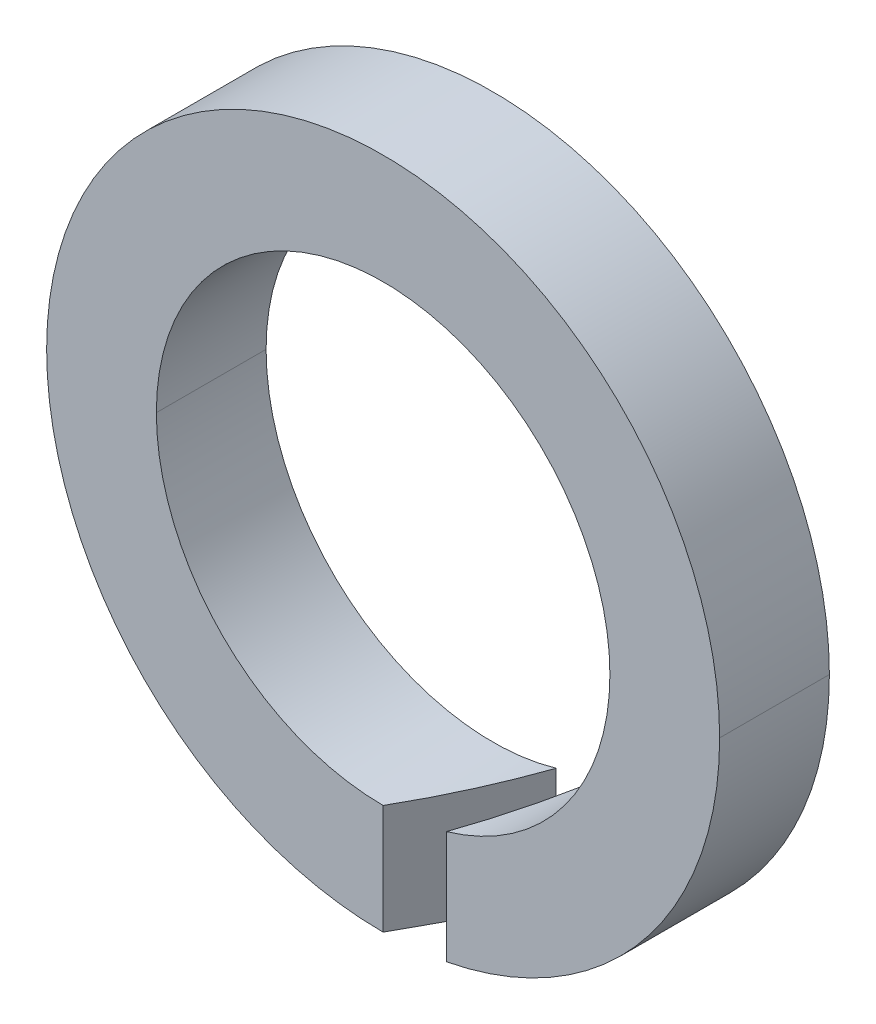
ISO-10303-21;
HEADER;
FILE_DESCRIPTION(('STEP AP214'),'2;1');
FILE_NAME('part.step','',(''),(''),'','','');
FILE_SCHEMA(('AUTOMOTIVE_DESIGN { 1 0 10303 214 1 1 1 1 }'));
ENDSEC;
DATA;
#1=APPLICATION_CONTEXT('core data for automotive mechanical design processes');
#2=APPLICATION_PROTOCOL_DEFINITION('international standard','automotive_design',2000,#1);
#3=PRODUCT_CONTEXT('',#1,'mechanical');
#4=PRODUCT('Part','Part','',(#3));
#5=PRODUCT_RELATED_PRODUCT_CATEGORY('part','',(#4));
#6=PRODUCT_DEFINITION_FORMATION('','',#4);
#7=PRODUCT_DEFINITION_CONTEXT('part definition',#1,'design');
#8=PRODUCT_DEFINITION('design','',#6,#7);
#9=PRODUCT_DEFINITION_SHAPE('','',#8);
#10=(LENGTH_UNIT() NAMED_UNIT(*) SI_UNIT(.MILLI.,.METRE.));
#11=(NAMED_UNIT(*) PLANE_ANGLE_UNIT() SI_UNIT($,.RADIAN.));
#12=(NAMED_UNIT(*) SI_UNIT($,.STERADIAN.) SOLID_ANGLE_UNIT());
#13=UNCERTAINTY_MEASURE_WITH_UNIT(LENGTH_MEASURE(1.E-05),#10,'distance_accuracy_value','');
#14=(GEOMETRIC_REPRESENTATION_CONTEXT(3) GLOBAL_UNCERTAINTY_ASSIGNED_CONTEXT((#13)) GLOBAL_UNIT_ASSIGNED_CONTEXT((#10,
#11,#12)) REPRESENTATION_CONTEXT('',''));
#15=CARTESIAN_POINT('',(0.,0.,0.));
#16=DIRECTION('',(0.,0.,1.));
#17=DIRECTION('',(1.,0.,0.));
#18=AXIS2_PLACEMENT_3D('',#15,#16,#17);
#19=CARTESIAN_POINT('',(0.,-6.44,0.));
#20=DIRECTION('',(-0.866025403784436,0.,-0.5));
#21=DIRECTION('',(-0.5,0.,0.866025403784436));
#22=AXIS2_PLACEMENT_3D('',#19,#20,#21);
#23=PLANE('',#22);
#24=CARTESIAN_POINT('',(0.,-6.44,0.));
#25=CARTESIAN_POINT('',(0.407180384011464,-6.44,-0.705257112953254));
#26=CARTESIAN_POINT('',(0.812536380981765,-6.40149830076559,-1.40735429485854));
#27=CARTESIAN_POINT('',(1.21243556529823,-6.32483991892285,-2.1));
#28=(BOUNDED_CURVE() B_SPLINE_CURVE(3,(#24,#25,#26,#27),.UNSPECIFIED.,.F.,
.F.) B_SPLINE_CURVE_WITH_KNOTS((4,4),(1.5707963267949,1.76019300097237),
.UNSPECIFIED.) CURVE() GEOMETRIC_REPRESENTATION_ITEM() RATIONAL_B_SPLINE_CURVE((1.,
0.997012974899577,0.997012974899577,1.)) REPRESENTATION_ITEM(''));
#29=CARTESIAN_POINT('',(0.,-6.44,0.));
#30=VERTEX_POINT('',#29);
#31=CARTESIAN_POINT('',(1.21243556529823,-6.32483991892285,-2.1));
#32=VERTEX_POINT('',#31);
#33=EDGE_CURVE('E11',#30,#32,#28,.T.);
#34=ORIENTED_EDGE('',*,*,#33,.T.);
#35=DIRECTION('',(0.,1.,0.));
#36=VECTOR('',#35,1.);
#37=CARTESIAN_POINT('',(1.21243556529823,-6.44,-2.1));
#38=LINE('',#37,#36);
#39=CARTESIAN_POINT('',(1.21243556529823,-4.16720529851842,-2.1));
#40=VERTEX_POINT('',#39);
#41=EDGE_CURVE('E30',#32,#40,#38,.T.);
#42=ORIENTED_EDGE('',*,*,#41,.T.);
#43=CARTESIAN_POINT('',(0.,-4.34,0.));
#44=CARTESIAN_POINT('',(0.410969765464196,-4.34,-0.711820514158645));
#45=CARTESIAN_POINT('',(0.817828333921898,-4.28201505886659,-1.41652022622212));
#46=CARTESIAN_POINT('',(1.21243556529823,-4.16720529851842,-2.1));
#47=(BOUNDED_CURVE() B_SPLINE_CURVE(3,(#43,#44,#45,#46),.UNSPECIFIED.,.F.,
.F.) B_SPLINE_CURVE_WITH_KNOTS((4,4),(1.5707963267949,1.85392699335113),
.UNSPECIFIED.) CURVE() GEOMETRIC_REPRESENTATION_ITEM() RATIONAL_B_SPLINE_CURVE((1.,
0.993330901115723,0.993330901115723,1.)) REPRESENTATION_ITEM(''));
#48=CARTESIAN_POINT('',(0.,-4.34,0.));
#49=VERTEX_POINT('',#48);
#50=EDGE_CURVE('E122',#49,#40,#47,.T.);
#51=ORIENTED_EDGE('',*,*,#50,.F.);
#52=DIRECTION('',(0.,1.,0.));
#53=VECTOR('',#52,1.);
#54=CARTESIAN_POINT('',(0.,-6.44,0.));
#55=LINE('',#54,#53);
#56=EDGE_CURVE('E104',#30,#49,#55,.T.);
#57=ORIENTED_EDGE('',*,*,#56,.F.);
#58=EDGE_LOOP('',(#34,#42,#51,#57));
#59=FACE_BOUND('',#58,.T.);
#60=ADVANCED_FACE('F17',(#59),#23,.F.);
#61=CARTESIAN_POINT('',(0.,0.,-2.1));
#62=DIRECTION('',(0.,0.,1.));
#63=DIRECTION('',(1.,0.,0.));
#64=AXIS2_PLACEMENT_3D('',#61,#62,#63);
#65=CYLINDRICAL_SURFACE('',#64,4.34);
#66=CARTESIAN_POINT('',(0.,0.,-2.1));
#67=DIRECTION('',(0.,0.,1.));
#68=DIRECTION('',(1.,0.,0.));
#69=AXIS2_PLACEMENT_3D('',#66,#67,#68);
#70=CIRCLE('',#69,4.34);
#71=CARTESIAN_POINT('',(-4.34,0.,-2.1));
#72=VERTEX_POINT('',#71);
#73=EDGE_CURVE('E152',#72,#40,#70,.T.);
#74=ORIENTED_EDGE('',*,*,#73,.F.);
#75=DIRECTION('',(0.,0.,1.));
#76=VECTOR('',#75,1.);
#77=CARTESIAN_POINT('',(-4.34,0.,-2.1));
#78=LINE('',#77,#76);
#79=CARTESIAN_POINT('',(-4.34,0.,0.));
#80=VERTEX_POINT('',#79);
#81=EDGE_CURVE('E129',#72,#80,#78,.T.);
#82=ORIENTED_EDGE('',*,*,#81,.T.);
#83=CARTESIAN_POINT('',(0.,0.,0.));
#84=DIRECTION('',(0.,0.,1.));
#85=DIRECTION('',(1.,0.,0.));
#86=AXIS2_PLACEMENT_3D('',#83,#84,#85);
#87=CIRCLE('',#86,4.34);
#88=EDGE_CURVE('E114',#80,#49,#87,.T.);
#89=ORIENTED_EDGE('',*,*,#88,.T.);
#90=ORIENTED_EDGE('',*,*,#50,.T.);
#91=EDGE_LOOP('',(#74,#82,#89,#90));
#92=FACE_BOUND('',#91,.T.);
#93=ADVANCED_FACE('F127',(#92),#65,.F.);
#94=CARTESIAN_POINT('',(0.,0.,-2.1));
#95=DIRECTION('',(0.,0.,1.));
#96=DIRECTION('',(1.,0.,0.));
#97=AXIS2_PLACEMENT_3D('',#94,#95,#96);
#98=CYLINDRICAL_SURFACE('',#97,6.44);
#99=DIRECTION('',(0.,0.,1.));
#100=VECTOR('',#99,1.);
#101=CARTESIAN_POINT('',(-6.44,0.,-2.1));
#102=LINE('',#101,#100);
#103=CARTESIAN_POINT('',(-6.44,0.,-2.1));
#104=VERTEX_POINT('',#103);
#105=CARTESIAN_POINT('',(-6.44,0.,0.));
#106=VERTEX_POINT('',#105);
#107=EDGE_CURVE('E161',#104,#106,#102,.T.);
#108=ORIENTED_EDGE('',*,*,#107,.F.);
#109=CARTESIAN_POINT('',(0.,0.,-2.1));
#110=DIRECTION('',(0.,0.,1.));
#111=DIRECTION('',(1.,0.,0.));
#112=AXIS2_PLACEMENT_3D('',#109,#110,#111);
#113=CIRCLE('',#112,6.44);
#114=EDGE_CURVE('E125',#104,#32,#113,.T.);
#115=ORIENTED_EDGE('',*,*,#114,.T.);
#116=ORIENTED_EDGE('',*,*,#33,.F.);
#117=CARTESIAN_POINT('',(0.,0.,0.));
#118=DIRECTION('',(0.,0.,1.));
#119=DIRECTION('',(1.,0.,0.));
#120=AXIS2_PLACEMENT_3D('',#117,#118,#119);
#121=CIRCLE('',#120,6.44);
#122=EDGE_CURVE('E118',#106,#30,#121,.T.);
#123=ORIENTED_EDGE('',*,*,#122,.F.);
#124=EDGE_LOOP('',(#108,#115,#116,#123));
#125=FACE_BOUND('',#124,.T.);
#126=ADVANCED_FACE('F249',(#125),#98,.T.);
#127=CARTESIAN_POINT('',(0.,0.,0.));
#128=DIRECTION('',(0.,0.,1.));
#129=DIRECTION('',(1.,0.,0.));
#130=AXIS2_PLACEMENT_3D('',#127,#128,#129);
#131=PLANE('',#130);
#132=DIRECTION('',(0.,1.,0.));
#133=VECTOR('',#132,1.);
#134=CARTESIAN_POINT('',(1.21243556529822,-6.44,0.));
#135=LINE('',#134,#133);
#136=CARTESIAN_POINT('',(1.21243556529822,-6.32483991892285,0.));
#137=VERTEX_POINT('',#136);
#138=CARTESIAN_POINT('',(1.21243556529822,-4.16720529851842,0.));
#139=VERTEX_POINT('',#138);
#140=EDGE_CURVE('E142',#137,#139,#135,.T.);
#141=ORIENTED_EDGE('',*,*,#140,.F.);
#142=CARTESIAN_POINT('',(0.,0.,0.));
#143=DIRECTION('',(0.,0.,1.));
#144=DIRECTION('',(1.,0.,0.));
#145=AXIS2_PLACEMENT_3D('',#142,#143,#144);
#146=CIRCLE('',#145,6.44);
#147=CARTESIAN_POINT('',(6.44,0.,0.));
#148=VERTEX_POINT('',#147);
#149=EDGE_CURVE('E141',#137,#148,#146,.T.);
#150=ORIENTED_EDGE('',*,*,#149,.T.);
#151=CARTESIAN_POINT('',(0.,0.,0.));
#152=DIRECTION('',(0.,0.,1.));
#153=DIRECTION('',(1.,0.,0.));
#154=AXIS2_PLACEMENT_3D('',#151,#152,#153);
#155=CIRCLE('',#154,6.44);
#156=EDGE_CURVE('E160',#148,#106,#155,.T.);
#157=ORIENTED_EDGE('',*,*,#156,.T.);
#158=ORIENTED_EDGE('',*,*,#122,.T.);
#159=ORIENTED_EDGE('',*,*,#56,.T.);
#160=ORIENTED_EDGE('',*,*,#88,.F.);
#161=CARTESIAN_POINT('',(0.,0.,0.));
#162=DIRECTION('',(0.,0.,1.));
#163=DIRECTION('',(1.,0.,0.));
#164=AXIS2_PLACEMENT_3D('',#161,#162,#163);
#165=CIRCLE('',#164,4.34);
#166=CARTESIAN_POINT('',(4.34,0.,0.));
#167=VERTEX_POINT('',#166);
#168=EDGE_CURVE('E178',#167,#80,#165,.T.);
#169=ORIENTED_EDGE('',*,*,#168,.F.);
#170=CARTESIAN_POINT('',(0.,0.,0.));
#171=DIRECTION('',(0.,0.,1.));
#172=DIRECTION('',(1.,0.,0.));
#173=AXIS2_PLACEMENT_3D('',#170,#171,#172);
#174=CIRCLE('',#173,4.34);
#175=EDGE_CURVE('E153',#139,#167,#174,.T.);
#176=ORIENTED_EDGE('',*,*,#175,.F.);
#177=EDGE_LOOP('',(#141,#150,#157,#158,#159,#160,#169,#176));
#178=FACE_BOUND('',#177,.T.);
#179=ADVANCED_FACE('F111',(#178),#131,.T.);
#180=CARTESIAN_POINT('',(0.,0.,-2.1));
#181=DIRECTION('',(0.,0.,1.));
#182=DIRECTION('',(1.,0.,0.));
#183=AXIS2_PLACEMENT_3D('',#180,#181,#182);
#184=PLANE('',#183);
#185=CARTESIAN_POINT('',(0.,0.,-2.1));
#186=DIRECTION('',(0.,0.,1.));
#187=DIRECTION('',(1.,0.,0.));
#188=AXIS2_PLACEMENT_3D('',#185,#186,#187);
#189=CIRCLE('',#188,6.44);
#190=CARTESIAN_POINT('',(2.42487113059645,-5.9660372107455,-2.1));
#191=VERTEX_POINT('',#190);
#192=CARTESIAN_POINT('',(6.44,0.,-2.1));
#193=VERTEX_POINT('',#192);
#194=EDGE_CURVE('E156',#191,#193,#189,.T.);
#195=ORIENTED_EDGE('',*,*,#194,.F.);
#196=DIRECTION('',(0.,1.,0.));
#197=VECTOR('',#196,1.);
#198=CARTESIAN_POINT('',(2.42487113059645,-6.44,-2.1));
#199=LINE('',#198,#197);
#200=CARTESIAN_POINT('',(2.42487113059645,-3.59938883701107,-2.1));
#201=VERTEX_POINT('',#200);
#202=EDGE_CURVE('E120',#191,#201,#199,.T.);
#203=ORIENTED_EDGE('',*,*,#202,.T.);
#204=CARTESIAN_POINT('',(0.,0.,-2.1));
#205=DIRECTION('',(0.,0.,1.));
#206=DIRECTION('',(1.,0.,0.));
#207=AXIS2_PLACEMENT_3D('',#204,#205,#206);
#208=CIRCLE('',#207,4.34);
#209=CARTESIAN_POINT('',(4.34,0.,-2.1));
#210=VERTEX_POINT('',#209);
#211=EDGE_CURVE('E151',#201,#210,#208,.T.);
#212=ORIENTED_EDGE('',*,*,#211,.T.);
#213=CARTESIAN_POINT('',(0.,0.,-2.1));
#214=DIRECTION('',(0.,0.,1.));
#215=DIRECTION('',(1.,0.,0.));
#216=AXIS2_PLACEMENT_3D('',#213,#214,#215);
#217=CIRCLE('',#216,4.34);
#218=EDGE_CURVE('E147',#210,#72,#217,.T.);
#219=ORIENTED_EDGE('',*,*,#218,.T.);
#220=ORIENTED_EDGE('',*,*,#73,.T.);
#221=ORIENTED_EDGE('',*,*,#41,.F.);
#222=ORIENTED_EDGE('',*,*,#114,.F.);
#223=CARTESIAN_POINT('',(0.,0.,-2.1));
#224=DIRECTION('',(0.,0.,1.));
#225=DIRECTION('',(1.,0.,0.));
#226=AXIS2_PLACEMENT_3D('',#223,#224,#225);
#227=CIRCLE('',#226,6.44);
#228=EDGE_CURVE('E163',#193,#104,#227,.T.);
#229=ORIENTED_EDGE('',*,*,#228,.F.);
#230=EDGE_LOOP('',(#195,#203,#212,#219,#220,#221,#222,#229));
#231=FACE_BOUND('',#230,.T.);
#232=ADVANCED_FACE('F214',(#231),#184,.F.);
#233=CARTESIAN_POINT('',(0.,0.,-2.1));
#234=DIRECTION('',(0.,0.,1.));
#235=DIRECTION('',(1.,0.,0.));
#236=AXIS2_PLACEMENT_3D('',#233,#234,#235);
#237=CYLINDRICAL_SURFACE('',#236,4.34);
#238=ORIENTED_EDGE('',*,*,#81,.F.);
#239=ORIENTED_EDGE('',*,*,#218,.F.);
#240=DIRECTION('',(0.,0.,1.));
#241=VECTOR('',#240,1.);
#242=CARTESIAN_POINT('',(4.34,0.,-2.1));
#243=LINE('',#242,#241);
#244=EDGE_CURVE('E182',#210,#167,#243,.T.);
#245=ORIENTED_EDGE('',*,*,#244,.T.);
#246=ORIENTED_EDGE('',*,*,#168,.T.);
#247=EDGE_LOOP('',(#238,#239,#245,#246));
#248=FACE_BOUND('',#247,.T.);
#249=ADVANCED_FACE('F216',(#248),#237,.F.);
#250=CARTESIAN_POINT('',(0.,0.,-2.1));
#251=DIRECTION('',(0.,0.,1.));
#252=DIRECTION('',(1.,0.,0.));
#253=AXIS2_PLACEMENT_3D('',#250,#251,#252);
#254=CYLINDRICAL_SURFACE('',#253,6.44);
#255=ORIENTED_EDGE('',*,*,#228,.T.);
#256=ORIENTED_EDGE('',*,*,#107,.T.);
#257=ORIENTED_EDGE('',*,*,#156,.F.);
#258=DIRECTION('',(0.,0.,1.));
#259=VECTOR('',#258,1.);
#260=CARTESIAN_POINT('',(6.44,0.,-2.1));
#261=LINE('',#260,#259);
#262=EDGE_CURVE('E174',#193,#148,#261,.T.);
#263=ORIENTED_EDGE('',*,*,#262,.F.);
#264=EDGE_LOOP('',(#255,#256,#257,#263));
#265=FACE_BOUND('',#264,.T.);
#266=ADVANCED_FACE('F277',(#265),#254,.T.);
#267=CARTESIAN_POINT('',(1.21243556529822,-6.44,0.));
#268=DIRECTION('',(0.866025403784436,0.,0.5));
#269=DIRECTION('',(0.,-1.,0.));
#270=AXIS2_PLACEMENT_3D('',#267,#268,#269);
#271=PLANE('',#270);
#272=CARTESIAN_POINT('',(2.42487113059645,-5.9660372107455,-2.1));
#273=CARTESIAN_POINT('',(2.03315773980592,-6.12524749711199,-1.42153250514574));
#274=CARTESIAN_POINT('',(1.62770694281934,-6.2452347757396,-0.71927112479569));
#275=CARTESIAN_POINT('',(1.21243556529822,-6.32483991892285,0.));
#276=(BOUNDED_CURVE() B_SPLINE_CURVE(3,(#272,#273,#274,#275),.UNSPECIFIED.,.F.,
.F.) B_SPLINE_CURVE_WITH_KNOTS((4,4),(4.32633820711676,4.52299230620722),
.UNSPECIFIED.) CURVE() GEOMETRIC_REPRESENTATION_ITEM() RATIONAL_B_SPLINE_CURVE((1.,
0.996779859446461,0.996779859446461,1.)) REPRESENTATION_ITEM(''));
#277=EDGE_CURVE('E21',#191,#137,#276,.T.);
#278=ORIENTED_EDGE('',*,*,#277,.T.);
#279=ORIENTED_EDGE('',*,*,#140,.T.);
#280=CARTESIAN_POINT('',(2.42487113059645,-3.59938883701107,-2.1));
#281=CARTESIAN_POINT('',(2.05177929175193,-3.8507369602737,-1.45378597923202));
#282=CARTESIAN_POINT('',(1.64438397600616,-4.0415312368871,-0.74815659359478));
#283=CARTESIAN_POINT('',(1.21243556529822,-4.16720529851842,0.));
#284=(BOUNDED_CURVE() B_SPLINE_CURVE(3,(#280,#281,#282,#283),.UNSPECIFIED.,.F.,
.F.) B_SPLINE_CURVE_WITH_KNOTS((4,4),(4.11954003441837,4.42925831382846),
.UNSPECIFIED.) CURVE() GEOMETRIC_REPRESENTATION_ITEM() RATIONAL_B_SPLINE_CURVE((1.,
0.992022177999076,0.992022177999076,1.)) REPRESENTATION_ITEM(''));
#285=EDGE_CURVE('E146',#201,#139,#284,.T.);
#286=ORIENTED_EDGE('',*,*,#285,.F.);
#287=ORIENTED_EDGE('',*,*,#202,.F.);
#288=EDGE_LOOP('',(#278,#279,#286,#287));
#289=FACE_BOUND('',#288,.T.);
#290=ADVANCED_FACE('F19',(#289),#271,.F.);
#291=CARTESIAN_POINT('',(0.,0.,-2.1));
#292=DIRECTION('',(0.,0.,1.));
#293=DIRECTION('',(1.,0.,0.));
#294=AXIS2_PLACEMENT_3D('',#291,#292,#293);
#295=CYLINDRICAL_SURFACE('',#294,4.34);
#296=ORIENTED_EDGE('',*,*,#244,.F.);
#297=ORIENTED_EDGE('',*,*,#211,.F.);
#298=ORIENTED_EDGE('',*,*,#285,.T.);
#299=ORIENTED_EDGE('',*,*,#175,.T.);
#300=EDGE_LOOP('',(#296,#297,#298,#299));
#301=FACE_BOUND('',#300,.T.);
#302=ADVANCED_FACE('F225',(#301),#295,.F.);
#303=CARTESIAN_POINT('',(0.,0.,-2.1));
#304=DIRECTION('',(0.,0.,1.));
#305=DIRECTION('',(1.,0.,0.));
#306=AXIS2_PLACEMENT_3D('',#303,#304,#305);
#307=CYLINDRICAL_SURFACE('',#306,6.44);
#308=ORIENTED_EDGE('',*,*,#194,.T.);
#309=ORIENTED_EDGE('',*,*,#262,.T.);
#310=ORIENTED_EDGE('',*,*,#149,.F.);
#311=ORIENTED_EDGE('',*,*,#277,.F.);
#312=EDGE_LOOP('',(#308,#309,#310,#311));
#313=FACE_BOUND('',#312,.T.);
#314=ADVANCED_FACE('F228',(#313),#307,.T.);
#315=CLOSED_SHELL('',(#60,#93,#126,#179,#232,#249,#266,#290,#302,#314));
#316=MANIFOLD_SOLID_BREP('B1',#315);
#317=ADVANCED_BREP_SHAPE_REPRESENTATION('',(#18,#316),#14);
#318=SHAPE_DEFINITION_REPRESENTATION(#9,#317);
ENDSEC;
END-ISO-10303-21;
